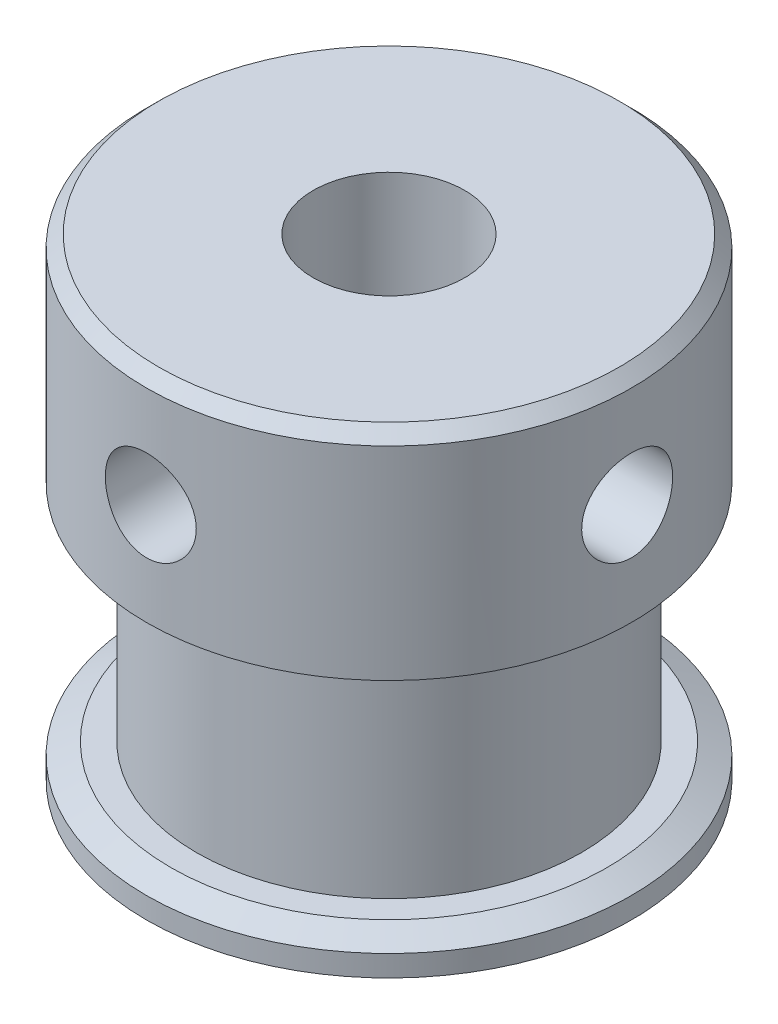
ISO-10303-21;
HEADER;
FILE_DESCRIPTION(('STEP AP214'),'2;1');
FILE_NAME('part.step','',(''),(''),'','','');
FILE_SCHEMA(('AUTOMOTIVE_DESIGN { 1 0 10303 214 1 1 1 1 }'));
ENDSEC;
DATA;
#1=APPLICATION_CONTEXT('core data for automotive mechanical design processes');
#2=APPLICATION_PROTOCOL_DEFINITION('international standard','automotive_design',2000,#1);
#3=PRODUCT_CONTEXT('',#1,'mechanical');
#4=PRODUCT('Part','Part','',(#3));
#5=PRODUCT_RELATED_PRODUCT_CATEGORY('part','',(#4));
#6=PRODUCT_DEFINITION_FORMATION('','',#4);
#7=PRODUCT_DEFINITION_CONTEXT('part definition',#1,'design');
#8=PRODUCT_DEFINITION('design','',#6,#7);
#9=PRODUCT_DEFINITION_SHAPE('','',#8);
#10=(LENGTH_UNIT() NAMED_UNIT(*) SI_UNIT(.MILLI.,.METRE.));
#11=(NAMED_UNIT(*) PLANE_ANGLE_UNIT() SI_UNIT($,.RADIAN.));
#12=(NAMED_UNIT(*) SI_UNIT($,.STERADIAN.) SOLID_ANGLE_UNIT());
#13=UNCERTAINTY_MEASURE_WITH_UNIT(LENGTH_MEASURE(1.E-05),#10,'distance_accuracy_value','');
#14=(GEOMETRIC_REPRESENTATION_CONTEXT(3) GLOBAL_UNCERTAINTY_ASSIGNED_CONTEXT((#13)) GLOBAL_UNIT_ASSIGNED_CONTEXT((#10,
#11,#12)) REPRESENTATION_CONTEXT('',''));
#15=CARTESIAN_POINT('',(0.,0.,0.));
#16=DIRECTION('',(0.,0.,1.));
#17=DIRECTION('',(1.,0.,0.));
#18=AXIS2_PLACEMENT_3D('',#15,#16,#17);
#19=CARTESIAN_POINT('',(0.,-3.15877434078089,0.));
#20=DIRECTION('',(0.,1.,0.));
#21=DIRECTION('',(0.,0.,1.));
#22=AXIS2_PLACEMENT_3D('',#19,#20,#21);
#23=CYLINDRICAL_SURFACE('',#22,2.5);
#24=CARTESIAN_POINT('',(0.,2.75,2.5));
#25=CARTESIAN_POINT('',(0.0767298334620157,2.75000409100988,2.49999625789732));
#26=CARTESIAN_POINT('',(0.153582320644177,2.75592867092627,2.4964290461501));
#27=CARTESIAN_POINT('',(0.304975509530678,2.77932431951533,2.48249903608568));
#28=CARTESIAN_POINT('',(0.379510034596047,2.79682386185422,2.47211948032719));
#29=CARTESIAN_POINT('',(0.523751827790837,2.84238636116686,2.44561558054488));
#30=CARTESIAN_POINT('',(0.593481028226566,2.87039695816316,2.42951973272944));
#31=CARTESIAN_POINT('',(0.727030318214658,2.93586033314103,2.39295367626407));
#32=CARTESIAN_POINT('',(0.790851869416383,2.97331076696875,2.37248455380255));
#33=CARTESIAN_POINT('',(0.916299278999315,3.05977482670859,2.32705360719088));
#34=CARTESIAN_POINT('',(0.977384020081416,3.10945369535139,2.30186792195985));
#35=CARTESIAN_POINT('',(1.09088270411891,3.21746720382827,2.25030439279633));
#36=CARTESIAN_POINT('',(1.14328534948112,3.27581293718732,2.2239250515357));
#37=CARTESIAN_POINT('',(1.24444996762974,3.40792351049673,2.1691106699591));
#38=CARTESIAN_POINT('',(1.29197766378809,3.48270177098129,2.14082017703649));
#39=CARTESIAN_POINT('',(1.37361437764896,3.64084657324311,2.08938301412124));
#40=CARTESIAN_POINT('',(1.4077451733516,3.72419889624757,2.06622802273938));
#41=CARTESIAN_POINT('',(1.45440601714221,3.87659645065324,2.0335462966093));
#42=CARTESIAN_POINT('',(1.47016197246826,3.94423599861031,2.02207883137591));
#43=CARTESIAN_POINT('',(1.49216172340475,4.08180371583036,2.00590308295503));
#44=CARTESIAN_POINT('',(1.49841734556836,4.15172892875449,2.0011863964376));
#45=CARTESIAN_POINT('',(1.50105508796009,4.29201149421734,1.99920922463856));
#46=CARTESIAN_POINT('',(1.49741783408418,4.3623694250932,2.00196337012718));
#47=CARTESIAN_POINT('',(1.48046060478828,4.50127877542759,2.01453261443741));
#48=CARTESIAN_POINT('',(1.46713334620103,4.56982879584745,2.02435302432226));
#49=CARTESIAN_POINT('',(1.43173921881792,4.70253024212811,2.04953186944258));
#50=CARTESIAN_POINT('',(1.40978748666087,4.76672705392448,2.06481711652537));
#51=CARTESIAN_POINT('',(1.35795061770837,4.89069499092812,2.09927051350828));
#52=CARTESIAN_POINT('',(1.32806257259705,4.95046448342392,2.11844008623465));
#53=CARTESIAN_POINT('',(1.25517983184583,5.0749840971228,2.16255327268986));
#54=CARTESIAN_POINT('',(1.21080724397723,5.13877809295493,2.18792043372992));
#55=CARTESIAN_POINT('',(1.11291092784003,5.25867648366701,2.23930599764381));
#56=CARTESIAN_POINT('',(1.05937845100578,5.3147734339765,2.26532500262149));
#57=CARTESIAN_POINT('',(0.935811834382964,5.42561298182175,2.31935504958317));
#58=CARTESIAN_POINT('',(0.864517682704955,5.47907730601599,2.34713836268532));
#59=CARTESIAN_POINT('',(0.712276050458999,5.57312204719791,2.39772428433981));
#60=CARTESIAN_POINT('',(0.631333763943564,5.61370935378996,2.42052955425515));
#61=CARTESIAN_POINT('',(0.467197585268206,5.6779321827959,2.45730392066151));
#62=CARTESIAN_POINT('',(0.384467624173579,5.70247535571592,2.47173957439704));
#63=CARTESIAN_POINT('',(0.215047895144639,5.73701119740538,2.49218842813551));
#64=CARTESIAN_POINT('',(0.128363005661318,5.74702131775357,2.49821172952738));
#65=CARTESIAN_POINT('',(-0.0337146143773969,5.75150784767831,2.5009057037461));
#66=CARTESIAN_POINT('',(-0.109042473418719,5.74790885508517,2.49873521714286));
#67=CARTESIAN_POINT('',(-0.257829401986061,5.72957414692808,2.48778712087048));
#68=CARTESIAN_POINT('',(-0.331288509376106,5.71483865719419,2.47900964518037));
#69=CARTESIAN_POINT('',(-0.472574932157613,5.67545656718754,2.4559479244219));
#70=CARTESIAN_POINT('',(-0.540495750928484,5.65105965092653,2.44180275662555));
#71=CARTESIAN_POINT('',(-0.671265749087263,5.59332262363473,2.40913880862845));
#72=CARTESIAN_POINT('',(-0.734113924963909,5.55998074865333,2.39061916586511));
#73=CARTESIAN_POINT('',(-0.860006262823864,5.4814430207913,2.34845496237361));
#74=CARTESIAN_POINT('',(-0.922394150456836,5.43537617092161,2.3244780273988));
#75=CARTESIAN_POINT('',(-1.03902603131014,5.33460860651138,2.27474265574732));
#76=CARTESIAN_POINT('',(-1.09326040273738,5.27989784514746,2.24898216586361));
#77=CARTESIAN_POINT('',(-1.19931996735579,5.15508960996285,2.19445423909891));
#78=CARTESIAN_POINT('',(-1.24991019630915,5.0839161145345,2.16573241746291));
#79=CARTESIAN_POINT('',(-1.33845238915667,4.9327839754318,2.1121618206671));
#80=CARTESIAN_POINT('',(-1.37641766769781,4.85283470610721,2.0873089799769));
#81=CARTESIAN_POINT('',(-1.43142578795776,4.70375697769331,2.04984909240519));
#82=CARTESIAN_POINT('',(-1.4512162533619,4.63601968764141,2.03575659328729));
#83=CARTESIAN_POINT('',(-1.48113663905972,4.4974679219199,2.01409605743544));
#84=CARTESIAN_POINT('',(-1.4912799529763,4.42665785567217,2.00651897642721));
#85=CARTESIAN_POINT('',(-1.50134130416631,4.28362305240297,1.99900446616267));
#86=CARTESIAN_POINT('',(-1.50122089107869,4.21139400931296,1.99909576445937));
#87=CARTESIAN_POINT('',(-1.49066472959328,4.06810556439054,2.0069771789285));
#88=CARTESIAN_POINT('',(-1.48022337215759,3.9970468199194,2.01477148138821));
#89=CARTESIAN_POINT('',(-1.45040174148913,3.86151158242781,2.0363318524298));
#90=CARTESIAN_POINT('',(-1.43147636845351,3.79688290569313,2.04979211805581));
#91=CARTESIAN_POINT('',(-1.38563242076993,3.67166274552578,2.08105501960152));
#92=CARTESIAN_POINT('',(-1.35871083588479,3.61107279303945,2.09885929040482));
#93=CARTESIAN_POINT('',(-1.29289245555732,3.48568014277922,2.14012990550917));
#94=CARTESIAN_POINT('',(-1.25279167675753,3.42165889614569,2.1640458758264));
#95=CARTESIAN_POINT('',(-1.16375698389084,3.30061992738271,2.21320127030768));
#96=CARTESIAN_POINT('',(-1.11481579607798,3.24360803784744,2.23844177205021));
#97=CARTESIAN_POINT('',(-1.00009777425734,3.12864905086833,2.29225690291477));
#98=CARTESIAN_POINT('',(-0.932876819313904,3.07206892510381,2.32070308663658));
#99=CARTESIAN_POINT('',(-0.788462434445589,2.97090214413669,2.37365428872367));
#100=CARTESIAN_POINT('',(-0.71126544450154,2.92631978801521,2.39815789310936));
#101=CARTESIAN_POINT('',(-0.551125230801454,2.85221419242626,2.43985578654394));
#102=CARTESIAN_POINT('',(-0.468430086957215,2.82227193507317,2.45725077479787));
#103=CARTESIAN_POINT('',(-0.297973306118809,2.77727530478903,2.48366273001246));
#104=CARTESIAN_POINT('',(-0.210232099648613,2.76216483214301,2.49271125871485));
#105=CARTESIAN_POINT('',(-0.101558096917536,2.75330254529134,2.49802001168187));
#106=CARTESIAN_POINT('',(-0.0812762590282777,2.75206558269391,2.49876114656362));
#107=CARTESIAN_POINT('',(-0.0406658206871125,2.75041375362914,2.49975164517367));
#108=CARTESIAN_POINT('',(-0.0203372186375695,2.7499989156791,2.50000099184316));
#109=CARTESIAN_POINT('',(0.,2.75,2.5));
#110=B_SPLINE_CURVE_WITH_KNOTS('',3,(#24,#25,#26,#27,#28,#29,#30,#31,#32,#33,#34,#35,#36,#37,
#38,#39,#40,#41,#42,#43,#44,#45,#46,#47,#48,#49,#50,#51,#52,#53,#54,#55,#56,#57,#58,#59,#60,#61,
#62,#63,#64,#65,#66,#67,#68,#69,#70,#71,#72,#73,#74,#75,#76,#77,#78,#79,#80,#81,#82,#83,#84,#85,
#86,#87,#88,#89,#90,#91,#92,#93,#94,#95,#96,#97,#98,#99,#100,#101,#102,#103,#104,#105,#106,#107,
#108,#109),.UNSPECIFIED.,.T.,.F.,(4,2,2,2,2,2,2,2,2,2,2,2,2,2,2,2,2,2,2,2,2,2,2,2,2,2,2,2,2,2,2,
2,2,2,2,2,2,2,2,2,2,2,4),(0.,0.230102237548649,0.460772627520012,0.690308884600012,
0.919788197992275,1.16681590732473,1.41416257934801,1.69183813189807,1.96906040692091,
2.17933829855633,2.38935420916578,2.59978170870726,2.81036753273873,3.01823267593207,
3.22617409809868,3.47046995225163,3.71500044803674,3.99360957884691,4.27206939275324,
4.53296790696559,4.79355286918236,5.01875602722426,5.24395461863455,5.46367785689772,
5.68344445659025,5.92601365818361,6.16886690081836,6.44336762428009,6.71757792616456,
6.93257787314692,7.14727888733318,7.36278425777432,7.57840681155725,7.78364098331142,
7.98895251523035,8.22578610052286,8.46281544370207,8.73854311775518,9.01436946031985,
9.28175654462676,9.54812832184448,9.60911473335177,9.6701032602764),.UNSPECIFIED.);
#111=CARTESIAN_POINT('',(0.,2.75,2.5));
#112=VERTEX_POINT('',#111);
#113=EDGE_CURVE('E63',#112,#112,#110,.T.);
#114=ORIENTED_EDGE('',*,*,#113,.T.);
#115=EDGE_LOOP('',(#114));
#116=FACE_BOUND('',#115,.T.);
#117=CARTESIAN_POINT('',(0.,8.,0.));
#118=DIRECTION('',(0.,1.,0.));
#119=DIRECTION('',(0.,0.,1.));
#120=AXIS2_PLACEMENT_3D('',#117,#118,#119);
#121=CIRCLE('',#120,2.5);
#122=CARTESIAN_POINT('',(0.,8.,2.5));
#123=VERTEX_POINT('',#122);
#124=EDGE_CURVE('E139',#123,#123,#121,.T.);
#125=ORIENTED_EDGE('',*,*,#124,.T.);
#126=EDGE_LOOP('',(#125));
#127=FACE_BOUND('',#126,.T.);
#128=CARTESIAN_POINT('',(0.,-8.,0.));
#129=DIRECTION('',(0.,1.,0.));
#130=DIRECTION('',(0.,0.,1.));
#131=AXIS2_PLACEMENT_3D('',#128,#129,#130);
#132=CIRCLE('',#131,2.5);
#133=CARTESIAN_POINT('',(0.,-8.,2.5));
#134=VERTEX_POINT('',#133);
#135=EDGE_CURVE('E142',#134,#134,#132,.T.);
#136=ORIENTED_EDGE('',*,*,#135,.F.);
#137=EDGE_LOOP('',(#136));
#138=FACE_BOUND('',#137,.T.);
#139=CARTESIAN_POINT('',(2.,4.25,-1.5));
#140=CARTESIAN_POINT('',(1.99999416642511,4.32547897528964,-1.50000404108592));
#141=CARTESIAN_POINT('',(2.00433633903481,4.4009384340798,-1.49426852824013));
#142=CARTESIAN_POINT('',(2.02092590613883,4.54932390396222,-1.47174965152787));
#143=CARTESIAN_POINT('',(2.03318155043097,4.6222471873851,-1.45495475788936));
#144=CARTESIAN_POINT('',(2.0636233903473,4.76308364167728,-1.41143486335795));
#145=CARTESIAN_POINT('',(2.0817666618312,4.83102883803527,-1.3847815450315));
#146=CARTESIAN_POINT('',(2.12185904995836,4.96143745336792,-1.32252909283019));
#147=CARTESIAN_POINT('',(2.14380930122416,5.02389922969514,-1.28692729054693));
#148=CARTESIAN_POINT('',(2.19228594587542,5.14994901666408,-1.20271292747644));
#149=CARTESIAN_POINT('',(2.21904371037662,5.21274095712394,-1.15304179435289));
#150=CARTESIAN_POINT('',(2.27226229431061,5.32976476274175,-1.04426801309985));
#151=CARTESIAN_POINT('',(2.29872287517103,5.3839901516708,-0.985158296729613));
#152=CARTESIAN_POINT('',(2.35175567858734,5.4881338097097,-0.851442367411701));
#153=CARTESIAN_POINT('',(2.37803133577818,5.53695446366975,-0.775851995162547));
#154=CARTESIAN_POINT('',(2.42443786983179,5.62080972244443,-0.615654228271658));
#155=CARTESIAN_POINT('',(2.44457437988735,5.65585697412272,-0.531055196626331));
#156=CARTESIAN_POINT('',(2.4747098780044,5.70759592281265,-0.363771406742667));
#157=CARTESIAN_POINT('',(2.4854930393917,5.7257203609673,-0.281674698130916));
#158=CARTESIAN_POINT('',(2.49874939277545,5.74794280286312,-0.114970509382708));
#159=CARTESIAN_POINT('',(2.50123038813307,5.75205397800005,-0.0303654624001535));
#160=CARTESIAN_POINT('',(2.49783372711539,5.74638625265754,0.127637283737309));
#161=CARTESIAN_POINT('',(2.49295437513726,5.73826647383069,0.201123832865634));
#162=CARTESIAN_POINT('',(2.47707997553857,5.71152020435189,0.345464269151768));
#163=CARTESIAN_POINT('',(2.46608447529309,5.69289293609285,0.416317961051202));
#164=CARTESIAN_POINT('',(2.4388490720172,5.64583443729623,0.55405678046908));
#165=CARTESIAN_POINT('',(2.42257910450824,5.61734693886101,0.620916491037616));
#166=CARTESIAN_POINT('',(2.38609637638748,5.55161538377446,0.748988660115609));
#167=CARTESIAN_POINT('',(2.36588259201812,5.51436905294099,0.81019964620801));
#168=CARTESIAN_POINT('',(2.32037925976363,5.42716090719555,0.9330742671432));
#169=CARTESIAN_POINT('',(2.2947718295215,5.37621168826426,0.993918663198194));
#170=CARTESIAN_POINT('',(2.24255554245601,5.26559588213982,1.10671465909275));
#171=CARTESIAN_POINT('',(2.21594536703375,5.20591749652549,1.1586540130834));
#172=CARTESIAN_POINT('',(2.16111075123946,5.07134659383645,1.25824837767417));
#173=CARTESIAN_POINT('',(2.13305661385124,4.99549242346054,1.30470933188632));
#174=CARTESIAN_POINT('',(2.08250879557267,4.8352937683634,1.38397217194232));
#175=CARTESIAN_POINT('',(2.06000490298821,4.75096528387436,1.41679921962189));
#176=CARTESIAN_POINT('',(2.02895865196732,4.59760636810466,1.46077497064842));
#177=CARTESIAN_POINT('',(2.01833888618316,4.52995936770336,1.47527903312665));
#178=CARTESIAN_POINT('',(2.00392150777558,4.39262638970052,1.49480872755284));
#179=CARTESIAN_POINT('',(2.00011596115116,4.32294287951544,1.49984538302907));
#180=CARTESIAN_POINT('',(1.99988914321323,4.18344831756429,1.50014781114183));
#181=CARTESIAN_POINT('',(2.00347810223984,4.11363722278479,1.49540004697659));
#182=CARTESIAN_POINT('',(2.01751520788652,3.97601265625144,1.47640290574941));
#183=CARTESIAN_POINT('',(2.02796877613213,3.90820080775974,1.46214601830139));
#184=CARTESIAN_POINT('',(2.054317683331,3.77628542052021,1.42488312618657));
#185=CARTESIAN_POINT('',(2.07020622092812,3.71217736346777,1.40188805257362));
#186=CARTESIAN_POINT('',(2.10571539417587,3.58852228426982,1.34796261057072));
#187=CARTESIAN_POINT('',(2.12533743689999,3.528976993634,1.31702924888212));
#188=CARTESIAN_POINT('',(2.17036819177737,3.40475991748775,1.24167439558512));
#189=CARTESIAN_POINT('',(2.19618239397369,3.34109916490343,1.19582663060303));
#190=CARTESIAN_POINT('',(2.2482175480362,3.22171451515054,1.09487395518701));
#191=CARTESIAN_POINT('',(2.27443886711455,3.16599830783089,1.03976018672402));
#192=CARTESIAN_POINT('',(2.32835625910913,3.05677599264957,0.913274837212767));
#193=CARTESIAN_POINT('',(2.3558007587587,3.00449927339416,0.840721108780192));
#194=CARTESIAN_POINT('',(2.40537639133459,2.91309722316335,0.68610310086802));
#195=CARTESIAN_POINT('',(2.42751104449411,2.87396317215908,0.604045176134703));
#196=CARTESIAN_POINT('',(2.46252280092775,2.81313179656864,0.438840232972139));
#197=CARTESIAN_POINT('',(2.47595588067329,2.79037377220889,0.356205963651259));
#198=CARTESIAN_POINT('',(2.494407389061,2.75928539715374,0.187383063890858));
#199=CARTESIAN_POINT('',(2.49943534582737,2.75093870928238,0.101198571781969));
#200=CARTESIAN_POINT('',(2.50040600461976,2.74932539141408,-0.0598120232009835));
#201=CARTESIAN_POINT('',(2.49747057186327,2.75419666543697,-0.134620583589706));
#202=CARTESIAN_POINT('',(2.48512948412095,2.77489382438161,-0.282148755978773));
#203=CARTESIAN_POINT('',(2.47572375706639,2.7907198313216,-0.354868344701914));
#204=CARTESIAN_POINT('',(2.45149427526962,2.83221957158378,-0.495145481978796));
#205=CARTESIAN_POINT('',(2.43675966858906,2.85773159612924,-0.562767032608829));
#206=CARTESIAN_POINT('',(2.40303337447155,2.91764059455475,-0.692781971999983));
#207=CARTESIAN_POINT('',(2.38404073252268,2.9520395608596,-0.755174184199831));
#208=CARTESIAN_POINT('',(2.34093432659381,3.03292519656876,-0.880263645295946));
#209=CARTESIAN_POINT('',(2.31648844639149,3.08031870901687,-0.942258690439939));
#210=CARTESIAN_POINT('',(2.26601907350661,3.18375303371772,-1.05789751536307));
#211=CARTESIAN_POINT('',(2.23999385274509,3.23980342560791,-1.11153190956916));
#212=CARTESIAN_POINT('',(2.18528165666205,3.3672855621777,-1.2159097535057));
#213=CARTESIAN_POINT('',(2.15667566270901,3.4397664861655,-1.26542406663367));
#214=CARTESIAN_POINT('',(2.10376464485145,3.59348485276654,-1.35156817210325));
#215=CARTESIAN_POINT('',(2.07945738811052,3.67471771398141,-1.38820466322661));
#216=CARTESIAN_POINT('',(2.0408000304796,3.8370642851372,-1.44437116535132));
#217=CARTESIAN_POINT('',(2.02577665830138,3.91759523596125,-1.46509526060187));
#218=CARTESIAN_POINT('',(2.00539032320036,4.08209739470368,-1.49289268240426));
#219=CARTESIAN_POINT('',(2.00000648744643,4.16606076575871,-1.49999550595837));
#220=CARTESIAN_POINT('',(2.,4.25,-1.5));
#221=B_SPLINE_CURVE_WITH_KNOTS('',3,(#139,#140,#141,#142,#143,#144,#145,#146,#147,#148,#149,
#150,#151,#152,#153,#154,#155,#156,#157,#158,#159,#160,#161,#162,#163,#164,#165,#166,#167,#168,
#169,#170,#171,#172,#173,#174,#175,#176,#177,#178,#179,#180,#181,#182,#183,#184,#185,#186,#187,
#188,#189,#190,#191,#192,#193,#194,#195,#196,#197,#198,#199,#200,#201,#202,#203,#204,#205,#206,
#207,#208,#209,#210,#211,#212,#213,#214,#215,#216,#217,#218,#219,#220),.UNSPECIFIED.,.T.,.F.,(4,
2,2,2,2,2,2,2,2,2,2,2,2,2,2,2,2,2,2,2,2,2,2,2,2,2,2,2,2,2,2,2,2,2,2,2,2,2,2,2,4),(0.,
0.226085249493392,0.45240657433077,0.677113624991877,0.901887762215934,1.15414462390001,
1.40659128601844,1.68630157736223,1.9657544327122,2.21853330858497,2.47107452602766,
2.69230130543181,2.91354445887944,3.13607155036376,3.35865648368878,3.60782810055849,
3.85733966656908,4.13576671140276,4.41367760154767,4.62276298054683,4.83160475643976,
5.04073566011182,5.25003193304128,5.45906724365495,5.66818149154661,5.91499438482002,
6.16204457978455,6.44121828011589,6.72020638384848,6.97891479383337,7.23732973022726,
7.46129321849399,7.68525920139648,7.90563970188756,8.12606965394585,8.37042963549487,
8.61506198741955,8.89071695766604,9.16622832484806,9.41820120134354,9.66962780912277),.UNSPECIFIED.);
#222=CARTESIAN_POINT('',(2.,4.25,-1.5));
#223=VERTEX_POINT('',#222);
#224=EDGE_CURVE('E71',#223,#223,#221,.T.);
#225=ORIENTED_EDGE('',*,*,#224,.T.);
#226=EDGE_LOOP('',(#225));
#227=FACE_BOUND('',#226,.T.);
#228=ADVANCED_FACE('F14',(#116,#127,#138,#227),#23,.F.);
#229=CARTESIAN_POINT('',(0.,-3.15877434078089,0.));
#230=DIRECTION('',(0.,1.,0.));
#231=DIRECTION('',(0.,0.,1.));
#232=AXIS2_PLACEMENT_3D('',#229,#230,#231);
#233=CYLINDRICAL_SURFACE('',#232,8.);
#234=CARTESIAN_POINT('',(0.,7.6,0.));
#235=DIRECTION('',(0.,1.,0.));
#236=DIRECTION('',(0.,0.,1.));
#237=AXIS2_PLACEMENT_3D('',#234,#235,#236);
#238=CIRCLE('',#237,8.);
#239=CARTESIAN_POINT('',(0.,7.6,8.));
#240=VERTEX_POINT('',#239);
#241=EDGE_CURVE('E34',#240,#240,#238,.F.);
#242=ORIENTED_EDGE('',*,*,#241,.T.);
#243=EDGE_LOOP('',(#242));
#244=FACE_BOUND('',#243,.T.);
#245=CARTESIAN_POINT('',(0.,0.9,0.));
#246=DIRECTION('',(0.,-1.,0.));
#247=DIRECTION('',(0.,0.,-1.));
#248=AXIS2_PLACEMENT_3D('',#245,#246,#247);
#249=CIRCLE('',#248,8.);
#250=CARTESIAN_POINT('',(0.,0.9,-8.));
#251=VERTEX_POINT('',#250);
#252=EDGE_CURVE('E149',#251,#251,#249,.F.);
#253=ORIENTED_EDGE('',*,*,#252,.T.);
#254=EDGE_LOOP('',(#253));
#255=FACE_BOUND('',#254,.T.);
#256=CARTESIAN_POINT('',(0.,2.75,8.));
#257=CARTESIAN_POINT('',(-0.0834717464654709,2.75000318958828,7.99999848833852));
#258=CARTESIAN_POINT('',(-0.166984992730099,2.75699107661938,7.99868009921714));
#259=CARTESIAN_POINT('',(-0.331658129841798,2.78473999511835,7.9935478589052));
#260=CARTESIAN_POINT('',(-0.412815974152225,2.80551265063974,7.98973190166897));
#261=CARTESIAN_POINT('',(-0.570372961851801,2.86017270125934,7.98003138765458));
#262=CARTESIAN_POINT('',(-0.646776330685344,2.89404825245254,7.97414869946483));
#263=CARTESIAN_POINT('',(-0.792807973094007,2.97391887692282,7.96095710599783));
#264=CARTESIAN_POINT('',(-0.862436794477322,3.01991296914482,7.95364831618289));
#265=CARTESIAN_POINT('',(-0.993783715930502,3.12329976800368,7.93831336430504));
#266=CARTESIAN_POINT('',(-1.05540895503183,3.18080944467014,7.93028034856351));
#267=CARTESIAN_POINT('',(-1.16819606135369,3.30534330908756,7.9144531845865));
#268=CARTESIAN_POINT('',(-1.21935717689241,3.37236817976929,7.90665905354528));
#269=CARTESIAN_POINT('',(-1.31014998665793,3.51468608836397,7.89212551245006));
#270=CARTESIAN_POINT('',(-1.34968721969605,3.59004037031724,7.88539493886182));
#271=CARTESIAN_POINT('',(-1.41550524332283,3.74646891517679,7.87384713211988));
#272=CARTESIAN_POINT('',(-1.44178717713098,3.82754268411122,7.86902973396963));
#273=CARTESIAN_POINT('',(-1.480050535035,3.99211523091441,7.86192269574551));
#274=CARTESIAN_POINT('',(-1.49219390192039,4.07557509720346,7.85960445366405));
#275=CARTESIAN_POINT('',(-1.50233808095346,4.24337738480825,7.85767197152761));
#276=CARTESIAN_POINT('',(-1.50034016135374,4.3277197263023,7.85805748898759));
#277=CARTESIAN_POINT('',(-1.48238979602362,4.49371952526605,7.86146292701752));
#278=CARTESIAN_POINT('',(-1.46662149996045,4.57539771430016,7.86444808147334));
#279=CARTESIAN_POINT('',(-1.42186799396207,4.73492841978261,7.87266183284667));
#280=CARTESIAN_POINT('',(-1.39288222239499,4.8127807735093,7.87789052509517));
#281=CARTESIAN_POINT('',(-1.322336471793,4.96298867900027,7.89003855292589));
#282=CARTESIAN_POINT('',(-1.28070213532456,5.03530847058081,7.89696783823366));
#283=CARTESIAN_POINT('',(-1.18609368930416,5.17200472854023,7.91172971602918));
#284=CARTESIAN_POINT('',(-1.13311842889266,5.2363803877148,7.91956240015522));
#285=CARTESIAN_POINT('',(-1.01633905685298,5.35642495567246,7.93540001272165));
#286=CARTESIAN_POINT('',(-0.952377436860683,5.41194065245174,7.94340571024031));
#287=CARTESIAN_POINT('',(-0.815968037098827,5.5114772406754,7.95857386108318));
#288=CARTESIAN_POINT('',(-0.743520172255768,5.55549801687042,7.96573630595245));
#289=CARTESIAN_POINT('',(-0.592034988874667,5.63081775387001,7.97842539677509));
#290=CARTESIAN_POINT('',(-0.512989564446493,5.66210077911789,7.98394999136289));
#291=CARTESIAN_POINT('',(-0.350639115398696,5.71090209309216,7.99272505402719));
#292=CARTESIAN_POINT('',(-0.267334544277787,5.72842184404536,7.99597576367995));
#293=CARTESIAN_POINT('',(-0.100148652903384,5.74898603101827,7.99980360641981));
#294=CARTESIAN_POINT('',(-0.0162940126341346,5.75224039152973,8.00041950912279));
#295=CARTESIAN_POINT('',(0.150761248092185,5.74474452045235,7.99901543598228));
#296=CARTESIAN_POINT('',(0.233961900480386,5.73399497693474,7.99699558964432));
#297=CARTESIAN_POINT('',(0.396681573218218,5.69897096481664,7.99057111500407));
#298=CARTESIAN_POINT('',(0.476224261046064,5.67480271746219,7.98618522374031));
#299=CARTESIAN_POINT('',(0.630128631824633,5.61374229322121,7.97551842212498));
#300=CARTESIAN_POINT('',(0.704489962595102,5.57684925243421,7.96923738311334));
#301=CARTESIAN_POINT('',(0.846816671513214,5.49092187184048,7.95538030357666));
#302=CARTESIAN_POINT('',(0.914703277015122,5.44175926146316,7.94779086174563));
#303=CARTESIAN_POINT('',(1.04133832326455,5.33286186263764,7.93219343489712));
#304=CARTESIAN_POINT('',(1.10008590976087,5.27312608699867,7.92418541084687));
#305=CARTESIAN_POINT('',(1.20757295872048,5.14382768108858,7.9085247569745));
#306=CARTESIAN_POINT('',(1.25616916218576,5.07414509187462,7.90087825860257));
#307=CARTESIAN_POINT('',(1.34096675057787,4.92748237547625,7.88692985578532));
#308=CARTESIAN_POINT('',(1.37716859613924,4.85050251962953,7.8806279013735));
#309=CARTESIAN_POINT('',(1.43594673512823,4.69179413275746,7.87013024209573));
#310=CARTESIAN_POINT('',(1.45858868794786,4.61009062044067,7.86592440436878));
#311=CARTESIAN_POINT('',(1.48980679326236,4.4439527774786,7.86007203802415));
#312=CARTESIAN_POINT('',(1.49838453270708,4.3595187560296,7.8584252206579));
#313=CARTESIAN_POINT('',(1.50117762148355,4.19175166855849,7.85789199803858));
#314=CARTESIAN_POINT('',(1.49561895003499,4.108422419043,7.85896215974294));
#315=CARTESIAN_POINT('',(1.47079175378803,3.94390857795471,7.86364600659998));
#316=CARTESIAN_POINT('',(1.45152331089332,3.86272397357256,7.86725967655746));
#317=CARTESIAN_POINT('',(1.39991887583263,3.70492551520452,7.8766050802318));
#318=CARTESIAN_POINT('',(1.36760735397252,3.62830340865423,7.88233284594965));
#319=CARTESIAN_POINT('',(1.29085868912204,3.48153174575916,7.8952638755184));
#320=CARTESIAN_POINT('',(1.24642068948186,3.41138264715522,7.90246724360119));
#321=CARTESIAN_POINT('',(1.14589487339535,3.27841631995771,7.91767266107745));
#322=CARTESIAN_POINT('',(1.08964259864303,3.2157245874329,7.92568505353043));
#323=CARTESIAN_POINT('',(0.967427926742291,3.10059483753548,7.94152833918735));
#324=CARTESIAN_POINT('',(0.901463301891616,3.04815917901986,7.94935919027328));
#325=CARTESIAN_POINT('',(0.760984945071873,2.95458904737294,7.96403975968048));
#326=CARTESIAN_POINT('',(0.686399590640516,2.91356057150936,7.97088000990561));
#327=CARTESIAN_POINT('',(0.531290113653833,2.84468236339487,7.98271619380687));
#328=CARTESIAN_POINT('',(0.450771651705248,2.81682025295309,7.98771385879038));
#329=CARTESIAN_POINT('',(0.308347202825154,2.78072268558133,7.99428290707632));
#330=CARTESIAN_POINT('',(0.24727381025187,2.7692213696872,7.99641470878206));
#331=CARTESIAN_POINT('',(0.124141247115157,2.75385893788355,7.9992737995401));
#332=CARTESIAN_POINT('',(0.0620821016527092,2.74999762774409,8.00000112429805));
#333=CARTESIAN_POINT('',(0.,2.75,8.));
#334=B_SPLINE_CURVE_WITH_KNOTS('',3,(#256,#257,#258,#259,#260,#261,#262,#263,#264,#265,#266,
#267,#268,#269,#270,#271,#272,#273,#274,#275,#276,#277,#278,#279,#280,#281,#282,#283,#284,#285,
#286,#287,#288,#289,#290,#291,#292,#293,#294,#295,#296,#297,#298,#299,#300,#301,#302,#303,#304,
#305,#306,#307,#308,#309,#310,#311,#312,#313,#314,#315,#316,#317,#318,#319,#320,#321,#322,#323,
#324,#325,#326,#327,#328,#329,#330,#331,#332,#333),.UNSPECIFIED.,.T.,.F.,(4,2,2,2,2,2,2,2,2,2,2,
2,2,2,2,2,2,2,2,2,2,2,2,2,2,2,2,2,2,2,2,2,2,2,2,2,2,2,4),(0.,0.250188200964924,
0.500587642535453,0.750761271230908,1.00091465336891,1.2537511801363,1.50660586283617,
1.76146190504357,2.01629596311948,2.26818151445336,2.52004447587256,2.76859000612766,
3.01714609846787,3.2671926262953,3.51726454049859,3.77127768464077,4.02529337544947,
4.27962588321698,4.53393136673745,4.78448174076096,5.03501980464583,5.28360233907828,
5.53220175338032,5.78351778017708,6.03485728413098,6.28953436987298,6.54420198954945,
6.79762627818559,7.05102196946513,7.30039252231748,7.54976158541506,7.79866496207692,
8.04758592655423,8.3002336996638,8.55293951262255,8.80792048916314,9.06266126931173,
9.24874344524409,9.4348208903954),.UNSPECIFIED.);
#335=CARTESIAN_POINT('',(0.,2.75,8.));
#336=VERTEX_POINT('',#335);
#337=EDGE_CURVE('E26',#336,#336,#334,.T.);
#338=ORIENTED_EDGE('',*,*,#337,.T.);
#339=EDGE_LOOP('',(#338));
#340=FACE_BOUND('',#339,.T.);
#341=CARTESIAN_POINT('',(7.85811682275086,4.25,-1.5));
#342=CARTESIAN_POINT('',(7.85811843793494,4.16654279198826,-1.49999679883246));
#343=CARTESIAN_POINT('',(7.85946079760267,4.08304405178161,-1.49301126348936));
#344=CARTESIAN_POINT('',(7.86467851014364,3.91840103841809,-1.46527253251805));
#345=CARTESIAN_POINT('',(7.86855601173205,3.83725882357252,-1.44450765768477));
#346=CARTESIAN_POINT('',(7.87838976464885,3.67973492862913,-1.38987035617787));
#347=CARTESIAN_POINT('',(7.88434407905997,3.60334889069271,-1.35601013954374));
#348=CARTESIAN_POINT('',(7.89765826320959,3.45734644071319,-1.27617565760366));
#349=CARTESIAN_POINT('',(7.90501802325622,3.3877295009967,-1.23020233759193));
#350=CARTESIAN_POINT('',(7.92041614838945,3.25636980080087,-1.12683678942622));
#351=CARTESIAN_POINT('',(7.92846116625679,3.19472351652827,-1.06932292933092));
#352=CARTESIAN_POINT('',(7.94426457664034,3.08189561040044,-0.94477177880355));
#353=CARTESIAN_POINT('',(7.95202295031153,3.03071467557521,-0.877733863624943));
#354=CARTESIAN_POINT('',(7.96645017828405,2.93990062339948,-0.735403894570162));
#355=CARTESIAN_POINT('',(7.97311028052363,2.90035846648058,-0.660052840033864));
#356=CARTESIAN_POINT('',(7.9845160863293,2.83453045772647,-0.503631283250761));
#357=CARTESIAN_POINT('',(7.98926194728334,2.80824351600978,-0.422561251859505));
#358=CARTESIAN_POINT('',(7.99625755123778,2.76997045138887,-0.258002746187415));
#359=CARTESIAN_POINT('',(7.99853565976327,2.75782169407732,-0.174553323244856));
#360=CARTESIAN_POINT('',(8.00043684615594,2.7476631122996,-0.00677167603538176));
#361=CARTESIAN_POINT('',(8.00006015010697,2.74965208386094,0.0775604724476715));
#362=CARTESIAN_POINT('',(7.99671633763241,2.76758777114715,0.243598357899398));
#363=CARTESIAN_POINT('',(7.99378172247214,2.78335936943001,0.32532376045147));
#364=CARTESIAN_POINT('',(7.98568826333561,2.82813564939524,0.484947165715476));
#365=CARTESIAN_POINT('',(7.98052933829966,2.8571408133458,0.562845028826542));
#366=CARTESIAN_POINT('',(7.96851260297339,2.9277277310583,0.713110065751522));
#367=CARTESIAN_POINT('',(7.96164537590825,2.9693794879125,0.785443571838534));
#368=CARTESIAN_POINT('',(7.9469714754285,3.06402566907715,0.922159977214638));
#369=CARTESIAN_POINT('',(7.93916470651164,3.11702124688758,0.986542066910785));
#370=CARTESIAN_POINT('',(7.92333513680566,3.23381570298353,1.10656561896904));
#371=CARTESIAN_POINT('',(7.91531085901621,3.29776778390207,1.16205790757041));
#372=CARTESIAN_POINT('',(7.90006508924621,3.43414953127863,1.26155171851261));
#373=CARTESIAN_POINT('',(7.89284360901351,3.50657932176463,1.30555307271182));
#374=CARTESIAN_POINT('',(7.88001893307122,3.65805827070266,1.38085852224478));
#375=CARTESIAN_POINT('',(7.87441850530261,3.73711845719064,1.41214093645421));
#376=CARTESIAN_POINT('',(7.86551242396689,3.8995011841232,1.46093656975056));
#377=CARTESIAN_POINT('',(7.8622065103862,3.98282324046479,1.47845134901108));
#378=CARTESIAN_POINT('',(7.85831520301005,4.15001932885588,1.49899672649739));
#379=CARTESIAN_POINT('',(7.85768955816136,4.23386611556551,1.50224164285859));
#380=CARTESIAN_POINT('',(7.8591219142084,4.40090345508715,1.49472968881725));
#381=CARTESIAN_POINT('',(7.86117978238611,4.48409404014808,1.48397351086433));
#382=CARTESIAN_POINT('',(7.86770980063205,4.64675290305439,1.44894868195883));
#383=CARTESIAN_POINT('',(7.87216186690878,4.72624625262489,1.4247923858399));
#384=CARTESIAN_POINT('',(7.88296134156619,4.88005718973016,1.3637722437906));
#385=CARTESIAN_POINT('',(7.88930888963281,4.95437439531533,1.32690746128795));
#386=CARTESIAN_POINT('',(7.90327577863685,5.09666761904317,1.2410235311966));
#387=CARTESIAN_POINT('',(7.91090895425315,5.16456053786607,1.19186899639621));
#388=CARTESIAN_POINT('',(7.926548113681,5.29121204021433,1.08298344344247));
#389=CARTESIAN_POINT('',(7.93455413096494,5.34996980155578,1.02325147433084));
#390=CARTESIAN_POINT('',(7.95016624005946,5.45748376353413,0.893949417870387));
#391=CARTESIAN_POINT('',(7.95776555833305,5.50609582660597,0.824258534095892));
#392=CARTESIAN_POINT('',(7.97159404810351,5.59092120617766,0.677574523040142));
#393=CARTESIAN_POINT('',(7.97782327234725,5.627135000025,0.600581677038529));
#394=CARTESIAN_POINT('',(7.98818057995848,5.68592009786408,0.441877541578685));
#395=CARTESIAN_POINT('',(7.99231954730142,5.70856218756141,0.360193213078989));
#396=CARTESIAN_POINT('',(7.99807642083745,5.73978704828989,0.194096227381571));
#397=CARTESIAN_POINT('',(7.99969459229933,5.74837129866271,0.109683858215852));
#398=CARTESIAN_POINT('',(8.00022227515441,5.75118530151844,-0.0580907602505086));
#399=CARTESIAN_POINT('',(7.99917286625032,5.74563275312953,-0.141449307066268));
#400=CARTESIAN_POINT('',(7.99456866611703,5.72080757223156,-0.306023369279199));
#401=CARTESIAN_POINT('',(7.99101389890671,5.70153507125579,-0.387238905213689));
#402=CARTESIAN_POINT('',(7.98179837978045,5.64990879261628,-0.545106475595484));
#403=CARTESIAN_POINT('',(7.97614135981576,5.61757818711899,-0.621766319318224));
#404=CARTESIAN_POINT('',(7.96333372068771,5.54077954634482,-0.768605631316694));
#405=CARTESIAN_POINT('',(7.95618300146483,5.49631069789334,-0.83878466500327));
#406=CARTESIAN_POINT('',(7.94104779859941,5.39574854555767,-0.971755027780005));
#407=CARTESIAN_POINT('',(7.93305284591272,5.33949796613829,-1.03442623539053));
#408=CARTESIAN_POINT('',(7.91719633538833,5.2172954375073,-1.14951536065485));
#409=CARTESIAN_POINT('',(7.90933480936765,5.15134120962628,-1.2019308632478));
#410=CARTESIAN_POINT('',(7.89455577425926,5.01087354529666,-1.29547633945385));
#411=CARTESIAN_POINT('',(7.88764767280729,4.93628656033237,-1.33649740531872));
#412=CARTESIAN_POINT('',(7.87567084650033,4.78117421002026,-1.40536132423416));
#413=CARTESIAN_POINT('',(7.87060038649117,4.70065453341062,-1.43321661638912));
#414=CARTESIAN_POINT('',(7.86393016292125,4.55824771193409,-1.46929726596175));
#415=CARTESIAN_POINT('',(7.86176310717932,4.49719427623806,-1.4807910573985));
#416=CARTESIAN_POINT('',(7.85885585595504,4.37410153157969,-1.49614351076215));
#417=CARTESIAN_POINT('',(7.85811562163283,4.31206224949967,-1.50000238052127));
#418=CARTESIAN_POINT('',(7.85811682275086,4.25,-1.5));
#419=B_SPLINE_CURVE_WITH_KNOTS('',3,(#341,#342,#343,#344,#345,#346,#347,#348,#349,#350,#351,
#352,#353,#354,#355,#356,#357,#358,#359,#360,#361,#362,#363,#364,#365,#366,#367,#368,#369,#370,
#371,#372,#373,#374,#375,#376,#377,#378,#379,#380,#381,#382,#383,#384,#385,#386,#387,#388,#389,
#390,#391,#392,#393,#394,#395,#396,#397,#398,#399,#400,#401,#402,#403,#404,#405,#406,#407,#408,
#409,#410,#411,#412,#413,#414,#415,#416,#417,#418),.UNSPECIFIED.,.T.,.F.,(4,2,2,2,2,2,2,2,2,2,2,
2,2,2,2,2,2,2,2,2,2,2,2,2,2,2,2,2,2,2,2,2,2,2,2,2,2,2,4),(0.,0.250144505793185,
0.500501302380392,0.750625227978433,1.00072963993908,1.25362335698691,1.50653367069315,
1.76137104348047,2.0161874593964,2.26804275460261,2.51987660200648,2.76855650598725,
3.01724547328425,3.26733691984219,3.51745380911785,3.77140614764064,4.025362201924,
4.27974936118266,4.53410768866488,4.78463248587075,5.03514489338718,5.28358792315368,
5.53204926624317,5.78337862654144,6.03473059394677,6.2894412549587,6.54414210821705,
6.79750269418683,7.0508366166733,7.30029300570138,7.54974700322167,7.79876026530358,
8.0477902135711,8.30038464008745,8.55303847730764,8.80803001818117,9.06278015749119,
9.24880307527214,9.43482092920425),.UNSPECIFIED.);
#420=CARTESIAN_POINT('',(7.85811682275086,4.25,-1.5));
#421=VERTEX_POINT('',#420);
#422=EDGE_CURVE('E10',#421,#421,#419,.T.);
#423=ORIENTED_EDGE('',*,*,#422,.T.);
#424=EDGE_LOOP('',(#423));
#425=FACE_BOUND('',#424,.T.);
#426=ADVANCED_FACE('F48',(#244,#255,#340,#425),#233,.T.);
#427=CARTESIAN_POINT('',(0.,-3.15877434078089,0.));
#428=DIRECTION('',(0.,1.,0.));
#429=DIRECTION('',(0.,0.,1.));
#430=AXIS2_PLACEMENT_3D('',#427,#428,#429);
#431=CYLINDRICAL_SURFACE('',#430,8.);
#432=CARTESIAN_POINT('',(0.,-6.9,0.));
#433=DIRECTION('',(0.,1.,0.));
#434=DIRECTION('',(0.,0.,1.));
#435=AXIS2_PLACEMENT_3D('',#432,#433,#434);
#436=CIRCLE('',#435,8.);
#437=CARTESIAN_POINT('',(0.,-6.9,8.));
#438=VERTEX_POINT('',#437);
#439=EDGE_CURVE('E113',#438,#438,#436,.F.);
#440=ORIENTED_EDGE('',*,*,#439,.T.);
#441=EDGE_LOOP('',(#440));
#442=FACE_BOUND('',#441,.T.);
#443=CARTESIAN_POINT('',(0.,-7.6,0.));
#444=DIRECTION('',(0.,-1.,0.));
#445=DIRECTION('',(0.,0.,-1.));
#446=AXIS2_PLACEMENT_3D('',#443,#444,#445);
#447=CIRCLE('',#446,8.);
#448=CARTESIAN_POINT('',(0.,-7.6,-8.));
#449=VERTEX_POINT('',#448);
#450=EDGE_CURVE('E110',#449,#449,#447,.F.);
#451=ORIENTED_EDGE('',*,*,#450,.T.);
#452=EDGE_LOOP('',(#451));
#453=FACE_BOUND('',#452,.T.);
#454=ADVANCED_FACE('F84',(#442,#453),#431,.T.);
#455=CARTESIAN_POINT('',(0.,-8.,2.29279304397315));
#456=DIRECTION('',(0.,-1.,0.));
#457=DIRECTION('',(0.,0.,-1.));
#458=AXIS2_PLACEMENT_3D('',#455,#456,#457);
#459=PLANE('',#458);
#460=CARTESIAN_POINT('',(0.,-8.,0.));
#461=DIRECTION('',(0.,-1.,0.));
#462=DIRECTION('',(0.,0.,-1.));
#463=AXIS2_PLACEMENT_3D('',#460,#461,#462);
#464=CIRCLE('',#463,7.2);
#465=CARTESIAN_POINT('',(0.,-8.,-7.2));
#466=VERTEX_POINT('',#465);
#467=EDGE_CURVE('E107',#466,#466,#464,.T.);
#468=ORIENTED_EDGE('',*,*,#467,.T.);
#469=EDGE_LOOP('',(#468));
#470=FACE_BOUND('',#469,.T.);
#471=ORIENTED_EDGE('',*,*,#135,.T.);
#472=EDGE_LOOP('',(#471));
#473=FACE_BOUND('',#472,.T.);
#474=ADVANCED_FACE('F80',(#470,#473),#459,.T.);
#475=CARTESIAN_POINT('',(0.,8.,6.22564207762479));
#476=DIRECTION('',(0.,1.,0.));
#477=DIRECTION('',(0.,0.,1.));
#478=AXIS2_PLACEMENT_3D('',#475,#476,#477);
#479=PLANE('',#478);
#480=CARTESIAN_POINT('',(0.,8.,0.));
#481=DIRECTION('',(0.,1.,0.));
#482=DIRECTION('',(0.,0.,1.));
#483=AXIS2_PLACEMENT_3D('',#480,#481,#482);
#484=CIRCLE('',#483,7.6);
#485=CARTESIAN_POINT('',(0.,8.,7.6));
#486=VERTEX_POINT('',#485);
#487=EDGE_CURVE('E42',#486,#486,#484,.T.);
#488=ORIENTED_EDGE('',*,*,#487,.T.);
#489=EDGE_LOOP('',(#488));
#490=FACE_BOUND('',#489,.T.);
#491=ORIENTED_EDGE('',*,*,#124,.F.);
#492=EDGE_LOOP('',(#491));
#493=FACE_BOUND('',#492,.T.);
#494=ADVANCED_FACE('F79',(#490,#493),#479,.T.);
#495=CARTESIAN_POINT('',(0.,0.5,6.63810501534939));
#496=DIRECTION('',(0.,-1.,0.));
#497=DIRECTION('',(0.,0.,-1.));
#498=AXIS2_PLACEMENT_3D('',#495,#496,#497);
#499=PLANE('',#498);
#500=CARTESIAN_POINT('',(0.,0.5,0.));
#501=DIRECTION('',(0.,-1.,0.));
#502=DIRECTION('',(0.,0.,-1.));
#503=AXIS2_PLACEMENT_3D('',#500,#501,#502);
#504=CIRCLE('',#503,7.2);
#505=CARTESIAN_POINT('',(0.,0.5,-7.2));
#506=VERTEX_POINT('',#505);
#507=EDGE_CURVE('E123',#506,#506,#504,.T.);
#508=ORIENTED_EDGE('',*,*,#507,.T.);
#509=EDGE_LOOP('',(#508));
#510=FACE_BOUND('',#509,.T.);
#511=CARTESIAN_POINT('',(0.,0.5,0.));
#512=DIRECTION('',(0.,1.,0.));
#513=DIRECTION('',(0.,0.,1.));
#514=AXIS2_PLACEMENT_3D('',#511,#512,#513);
#515=CIRCLE('',#514,6.35);
#516=CARTESIAN_POINT('',(0.,0.5,6.35));
#517=VERTEX_POINT('',#516);
#518=EDGE_CURVE('E143',#517,#517,#515,.T.);
#519=ORIENTED_EDGE('',*,*,#518,.T.);
#520=EDGE_LOOP('',(#519));
#521=FACE_BOUND('',#520,.T.);
#522=ADVANCED_FACE('F136',(#510,#521),#499,.T.);
#523=CARTESIAN_POINT('',(0.,-3.15877434078089,0.));
#524=DIRECTION('',(0.,1.,0.));
#525=DIRECTION('',(0.,0.,1.));
#526=AXIS2_PLACEMENT_3D('',#523,#524,#525);
#527=CYLINDRICAL_SURFACE('',#526,6.35);
#528=CARTESIAN_POINT('',(0.,-6.5,0.));
#529=DIRECTION('',(0.,1.,0.));
#530=DIRECTION('',(0.,0.,1.));
#531=AXIS2_PLACEMENT_3D('',#528,#529,#530);
#532=CIRCLE('',#531,6.35);
#533=CARTESIAN_POINT('',(0.,-6.5,6.35));
#534=VERTEX_POINT('',#533);
#535=EDGE_CURVE('E70',#534,#534,#532,.T.);
#536=ORIENTED_EDGE('',*,*,#535,.T.);
#537=EDGE_LOOP('',(#536));
#538=FACE_BOUND('',#537,.T.);
#539=ORIENTED_EDGE('',*,*,#518,.F.);
#540=EDGE_LOOP('',(#539));
#541=FACE_BOUND('',#540,.T.);
#542=ADVANCED_FACE('F192',(#538,#541),#527,.T.);
#543=CARTESIAN_POINT('',(0.,-6.5,6.63810501534939));
#544=DIRECTION('',(0.,1.,0.));
#545=DIRECTION('',(0.,0.,1.));
#546=AXIS2_PLACEMENT_3D('',#543,#544,#545);
#547=PLANE('',#546);
#548=CARTESIAN_POINT('',(0.,-6.5,0.));
#549=DIRECTION('',(0.,1.,0.));
#550=DIRECTION('',(0.,0.,1.));
#551=AXIS2_PLACEMENT_3D('',#548,#549,#550);
#552=CIRCLE('',#551,7.2);
#553=CARTESIAN_POINT('',(0.,-6.5,7.2));
#554=VERTEX_POINT('',#553);
#555=EDGE_CURVE('E114',#554,#554,#552,.T.);
#556=ORIENTED_EDGE('',*,*,#555,.T.);
#557=EDGE_LOOP('',(#556));
#558=FACE_BOUND('',#557,.T.);
#559=ORIENTED_EDGE('',*,*,#535,.F.);
#560=EDGE_LOOP('',(#559));
#561=FACE_BOUND('',#560,.T.);
#562=ADVANCED_FACE('F59',(#558,#561),#547,.T.);
#563=CARTESIAN_POINT('',(0.,0.9,0.));
#564=DIRECTION('',(0.,1.,0.));
#565=DIRECTION('',(0.,0.,1.));
#566=AXIS2_PLACEMENT_3D('',#563,#564,#565);
#567=CONICAL_SURFACE('',#566,8.,1.10714871779409);
#568=ORIENTED_EDGE('',*,*,#507,.F.);
#569=EDGE_LOOP('',(#568));
#570=FACE_BOUND('',#569,.T.);
#571=ORIENTED_EDGE('',*,*,#252,.F.);
#572=EDGE_LOOP('',(#571));
#573=FACE_BOUND('',#572,.T.);
#574=ADVANCED_FACE('F89',(#570,#573),#567,.T.);
#575=CARTESIAN_POINT('',(0.,-6.5,0.));
#576=DIRECTION('',(0.,-1.,0.));
#577=DIRECTION('',(0.,0.,-1.));
#578=AXIS2_PLACEMENT_3D('',#575,#576,#577);
#579=CONICAL_SURFACE('',#578,7.2,1.10714871779409);
#580=ORIENTED_EDGE('',*,*,#439,.F.);
#581=EDGE_LOOP('',(#580));
#582=FACE_BOUND('',#581,.T.);
#583=ORIENTED_EDGE('',*,*,#555,.F.);
#584=EDGE_LOOP('',(#583));
#585=FACE_BOUND('',#584,.T.);
#586=ADVANCED_FACE('F92',(#582,#585),#579,.T.);
#587=CARTESIAN_POINT('',(0.,-7.6,0.));
#588=DIRECTION('',(0.,1.,0.));
#589=DIRECTION('',(0.,0.,1.));
#590=AXIS2_PLACEMENT_3D('',#587,#588,#589);
#591=CONICAL_SURFACE('',#590,8.,1.10714871779409);
#592=ORIENTED_EDGE('',*,*,#467,.F.);
#593=EDGE_LOOP('',(#592));
#594=FACE_BOUND('',#593,.T.);
#595=ORIENTED_EDGE('',*,*,#450,.F.);
#596=EDGE_LOOP('',(#595));
#597=FACE_BOUND('',#596,.T.);
#598=ADVANCED_FACE('F95',(#594,#597),#591,.T.);
#599=CARTESIAN_POINT('',(0.,8.,0.));
#600=DIRECTION('',(0.,-1.,0.));
#601=DIRECTION('',(0.,0.,-1.));
#602=AXIS2_PLACEMENT_3D('',#599,#600,#601);
#603=CONICAL_SURFACE('',#602,7.6,0.785398163397448);
#604=ORIENTED_EDGE('',*,*,#241,.F.);
#605=EDGE_LOOP('',(#604));
#606=FACE_BOUND('',#605,.T.);
#607=ORIENTED_EDGE('',*,*,#487,.F.);
#608=EDGE_LOOP('',(#607));
#609=FACE_BOUND('',#608,.T.);
#610=ADVANCED_FACE('F16',(#606,#609),#603,.T.);
#611=CARTESIAN_POINT('',(0.,4.25,3.47841294710476));
#612=DIRECTION('',(0.,0.,1.));
#613=DIRECTION('',(1.,0.,0.));
#614=AXIS2_PLACEMENT_3D('',#611,#612,#613);
#615=CYLINDRICAL_SURFACE('',#614,1.5);
#616=ORIENTED_EDGE('',*,*,#113,.F.);
#617=EDGE_LOOP('',(#616));
#618=FACE_BOUND('',#617,.T.);
#619=ORIENTED_EDGE('',*,*,#337,.F.);
#620=EDGE_LOOP('',(#619));
#621=FACE_BOUND('',#620,.T.);
#622=ADVANCED_FACE('F52',(#618,#621),#615,.F.);
#623=CARTESIAN_POINT('',(3.47841294710476,4.25,0.));
#624=DIRECTION('',(1.,0.,0.));
#625=DIRECTION('',(0.,0.,-1.));
#626=AXIS2_PLACEMENT_3D('',#623,#624,#625);
#627=CYLINDRICAL_SURFACE('',#626,1.5);
#628=ORIENTED_EDGE('',*,*,#224,.F.);
#629=EDGE_LOOP('',(#628));
#630=FACE_BOUND('',#629,.T.);
#631=ORIENTED_EDGE('',*,*,#422,.F.);
#632=EDGE_LOOP('',(#631));
#633=FACE_BOUND('',#632,.T.);
#634=ADVANCED_FACE('F56',(#630,#633),#627,.F.);
#635=CLOSED_SHELL('',(#228,#426,#454,#474,#494,#522,#542,#562,#574,#586,#598,#610,#622,#634));
#636=MANIFOLD_SOLID_BREP('B1',#635);
#637=ADVANCED_BREP_SHAPE_REPRESENTATION('',(#18,#636),#14);
#638=SHAPE_DEFINITION_REPRESENTATION(#9,#637);
ENDSEC;
END-ISO-10303-21;
